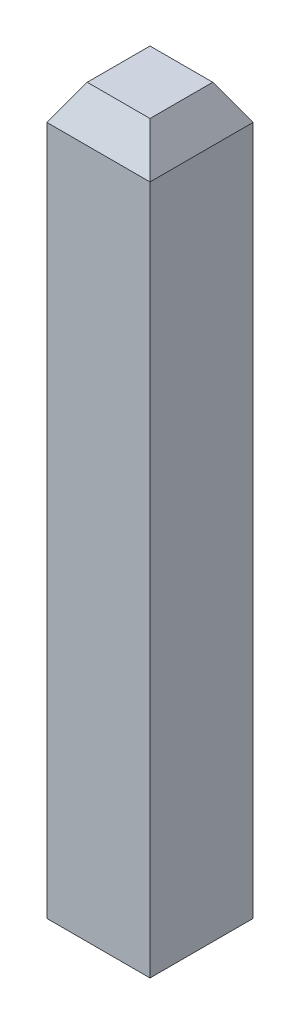
ISO-10303-21;
HEADER;
FILE_DESCRIPTION(('STEP AP214'),'2;1');
FILE_NAME('part.step','',(''),(''),'','','');
FILE_SCHEMA(('AUTOMOTIVE_DESIGN { 1 0 10303 214 1 1 1 1 }'));
ENDSEC;
DATA;
#1=APPLICATION_CONTEXT('core data for automotive mechanical design processes');
#2=APPLICATION_PROTOCOL_DEFINITION('international standard','automotive_design',2000,#1);
#3=PRODUCT_CONTEXT('',#1,'mechanical');
#4=PRODUCT('Part','Part','',(#3));
#5=PRODUCT_RELATED_PRODUCT_CATEGORY('part','',(#4));
#6=PRODUCT_DEFINITION_FORMATION('','',#4);
#7=PRODUCT_DEFINITION_CONTEXT('part definition',#1,'design');
#8=PRODUCT_DEFINITION('design','',#6,#7);
#9=PRODUCT_DEFINITION_SHAPE('','',#8);
#10=(LENGTH_UNIT() NAMED_UNIT(*) SI_UNIT(.MILLI.,.METRE.));
#11=(NAMED_UNIT(*) PLANE_ANGLE_UNIT() SI_UNIT($,.RADIAN.));
#12=(NAMED_UNIT(*) SI_UNIT($,.STERADIAN.) SOLID_ANGLE_UNIT());
#13=UNCERTAINTY_MEASURE_WITH_UNIT(LENGTH_MEASURE(1.E-05),#10,'distance_accuracy_value','');
#14=(GEOMETRIC_REPRESENTATION_CONTEXT(3) GLOBAL_UNCERTAINTY_ASSIGNED_CONTEXT((#13)) GLOBAL_UNIT_ASSIGNED_CONTEXT((#10,
#11,#12)) REPRESENTATION_CONTEXT('',''));
#15=CARTESIAN_POINT('',(0.,0.,0.));
#16=DIRECTION('',(0.,0.,1.));
#17=DIRECTION('',(1.,0.,0.));
#18=AXIS2_PLACEMENT_3D('',#15,#16,#17);
#19=CARTESIAN_POINT('',(1.57,6.8,0.18));
#20=DIRECTION('',(-1.,0.,0.));
#21=DIRECTION('',(0.,0.,1.));
#22=AXIS2_PLACEMENT_3D('',#19,#20,#21);
#23=PLANE('',#22);
#24=DIRECTION('',(0.,-1.,0.));
#25=VECTOR('',#24,1.);
#26=CARTESIAN_POINT('',(1.57,6.8,0.18));
#27=LINE('',#26,#25);
#28=CARTESIAN_POINT('',(1.57,6.58349364905389,0.18));
#29=VERTEX_POINT('',#28);
#30=CARTESIAN_POINT('',(1.57,2.3,0.18));
#31=VERTEX_POINT('',#30);
#32=EDGE_CURVE('E11',#29,#31,#27,.T.);
#33=ORIENTED_EDGE('',*,*,#32,.F.);
#34=DIRECTION('',(0.,0.,1.));
#35=VECTOR('',#34,1.);
#36=CARTESIAN_POINT('',(1.57,6.58349364905389,0.18));
#37=LINE('',#36,#35);
#38=CARTESIAN_POINT('',(1.57,6.58349364905389,0.82));
#39=VERTEX_POINT('',#38);
#40=EDGE_CURVE('E24',#29,#39,#37,.T.);
#41=ORIENTED_EDGE('',*,*,#40,.T.);
#42=DIRECTION('',(0.,-1.,0.));
#43=VECTOR('',#42,1.);
#44=CARTESIAN_POINT('',(1.57,6.8,0.82));
#45=LINE('',#44,#43);
#46=CARTESIAN_POINT('',(1.57,2.3,0.82));
#47=VERTEX_POINT('',#46);
#48=EDGE_CURVE('E117',#39,#47,#45,.T.);
#49=ORIENTED_EDGE('',*,*,#48,.T.);
#50=DIRECTION('',(0.,0.,-1.));
#51=VECTOR('',#50,1.);
#52=CARTESIAN_POINT('',(1.57,2.3,0.18));
#53=LINE('',#52,#51);
#54=EDGE_CURVE('E115',#47,#31,#53,.T.);
#55=ORIENTED_EDGE('',*,*,#54,.T.);
#56=EDGE_LOOP('',(#33,#41,#49,#55));
#57=FACE_BOUND('',#56,.T.);
#58=ADVANCED_FACE('F17',(#57),#23,.F.);
#59=CARTESIAN_POINT('',(0.93,6.8,0.18));
#60=DIRECTION('',(0.,0.,1.));
#61=DIRECTION('',(1.,0.,0.));
#62=AXIS2_PLACEMENT_3D('',#59,#60,#61);
#63=PLANE('',#62);
#64=DIRECTION('',(0.,-1.,0.));
#65=VECTOR('',#64,1.);
#66=CARTESIAN_POINT('',(0.93,6.8,0.18));
#67=LINE('',#66,#65);
#68=CARTESIAN_POINT('',(0.93,6.58349364905389,0.18));
#69=VERTEX_POINT('',#68);
#70=CARTESIAN_POINT('',(0.93,2.3,0.18));
#71=VERTEX_POINT('',#70);
#72=EDGE_CURVE('E113',#69,#71,#67,.T.);
#73=ORIENTED_EDGE('',*,*,#72,.F.);
#74=DIRECTION('',(1.,0.,0.));
#75=VECTOR('',#74,1.);
#76=CARTESIAN_POINT('',(0.93,6.58349364905389,0.18));
#77=LINE('',#76,#75);
#78=EDGE_CURVE('E111',#69,#29,#77,.T.);
#79=ORIENTED_EDGE('',*,*,#78,.T.);
#80=ORIENTED_EDGE('',*,*,#32,.T.);
#81=DIRECTION('',(-1.,0.,0.));
#82=VECTOR('',#81,1.);
#83=CARTESIAN_POINT('',(0.93,2.3,0.18));
#84=LINE('',#83,#82);
#85=EDGE_CURVE('E109',#31,#71,#84,.T.);
#86=ORIENTED_EDGE('',*,*,#85,.T.);
#87=EDGE_LOOP('',(#73,#79,#80,#86));
#88=FACE_BOUND('',#87,.T.);
#89=ADVANCED_FACE('F139',(#88),#63,.F.);
#90=CARTESIAN_POINT('',(0.93,6.8,0.82));
#91=DIRECTION('',(1.,0.,0.));
#92=DIRECTION('',(0.,0.,-1.));
#93=AXIS2_PLACEMENT_3D('',#90,#91,#92);
#94=PLANE('',#93);
#95=DIRECTION('',(0.,-1.,0.));
#96=VECTOR('',#95,1.);
#97=CARTESIAN_POINT('',(0.93,6.8,0.82));
#98=LINE('',#97,#96);
#99=CARTESIAN_POINT('',(0.93,6.58349364905389,0.82));
#100=VERTEX_POINT('',#99);
#101=CARTESIAN_POINT('',(0.93,2.3,0.82));
#102=VERTEX_POINT('',#101);
#103=EDGE_CURVE('E107',#100,#102,#98,.T.);
#104=ORIENTED_EDGE('',*,*,#103,.F.);
#105=DIRECTION('',(0.,0.,-1.));
#106=VECTOR('',#105,1.);
#107=CARTESIAN_POINT('',(0.93,6.58349364905389,0.82));
#108=LINE('',#107,#106);
#109=EDGE_CURVE('E104',#100,#69,#108,.T.);
#110=ORIENTED_EDGE('',*,*,#109,.T.);
#111=ORIENTED_EDGE('',*,*,#72,.T.);
#112=DIRECTION('',(0.,0.,1.));
#113=VECTOR('',#112,1.);
#114=CARTESIAN_POINT('',(0.93,2.3,0.82));
#115=LINE('',#114,#113);
#116=EDGE_CURVE('E101',#71,#102,#115,.T.);
#117=ORIENTED_EDGE('',*,*,#116,.T.);
#118=EDGE_LOOP('',(#104,#110,#111,#117));
#119=FACE_BOUND('',#118,.T.);
#120=ADVANCED_FACE('F134',(#119),#94,.F.);
#121=CARTESIAN_POINT('',(1.57,6.8,0.82));
#122=DIRECTION('',(0.,0.,-1.));
#123=DIRECTION('',(-1.,0.,0.));
#124=AXIS2_PLACEMENT_3D('',#121,#122,#123);
#125=PLANE('',#124);
#126=ORIENTED_EDGE('',*,*,#48,.F.);
#127=DIRECTION('',(-1.,0.,0.));
#128=VECTOR('',#127,1.);
#129=CARTESIAN_POINT('',(1.57,6.58349364905389,0.82));
#130=LINE('',#129,#128);
#131=EDGE_CURVE('E98',#39,#100,#130,.T.);
#132=ORIENTED_EDGE('',*,*,#131,.T.);
#133=ORIENTED_EDGE('',*,*,#103,.T.);
#134=DIRECTION('',(1.,0.,0.));
#135=VECTOR('',#134,1.);
#136=CARTESIAN_POINT('',(1.57,2.3,0.82));
#137=LINE('',#136,#135);
#138=EDGE_CURVE('E95',#102,#47,#137,.T.);
#139=ORIENTED_EDGE('',*,*,#138,.T.);
#140=EDGE_LOOP('',(#126,#132,#133,#139));
#141=FACE_BOUND('',#140,.T.);
#142=ADVANCED_FACE('F122',(#141),#125,.F.);
#143=CARTESIAN_POINT('',(0.,6.8,0.));
#144=DIRECTION('',(0.,-1.,0.));
#145=DIRECTION('',(0.,0.,-1.));
#146=AXIS2_PLACEMENT_3D('',#143,#144,#145);
#147=PLANE('',#146);
#148=DIRECTION('',(0.,0.,1.));
#149=VECTOR('',#148,1.);
#150=CARTESIAN_POINT('',(1.055,6.8,0.));
#151=LINE('',#150,#149);
#152=CARTESIAN_POINT('',(1.055,6.8,0.305000000000001));
#153=VERTEX_POINT('',#152);
#154=CARTESIAN_POINT('',(1.055,6.8,0.694999999999999));
#155=VERTEX_POINT('',#154);
#156=EDGE_CURVE('E93',#153,#155,#151,.T.);
#157=ORIENTED_EDGE('',*,*,#156,.T.);
#158=DIRECTION('',(1.,0.,0.));
#159=VECTOR('',#158,1.);
#160=CARTESIAN_POINT('',(0.,6.8,0.694999999999999));
#161=LINE('',#160,#159);
#162=CARTESIAN_POINT('',(1.445,6.8,0.694999999999999));
#163=VERTEX_POINT('',#162);
#164=EDGE_CURVE('E72',#155,#163,#161,.T.);
#165=ORIENTED_EDGE('',*,*,#164,.T.);
#166=DIRECTION('',(0.,0.,-1.));
#167=VECTOR('',#166,1.);
#168=CARTESIAN_POINT('',(1.445,6.8,0.));
#169=LINE('',#168,#167);
#170=CARTESIAN_POINT('',(1.445,6.8,0.305000000000001));
#171=VERTEX_POINT('',#170);
#172=EDGE_CURVE('E66',#163,#171,#169,.T.);
#173=ORIENTED_EDGE('',*,*,#172,.T.);
#174=DIRECTION('',(-1.,0.,0.));
#175=VECTOR('',#174,1.);
#176=CARTESIAN_POINT('',(0.,6.8,0.305000000000001));
#177=LINE('',#176,#175);
#178=EDGE_CURVE('E69',#171,#153,#177,.T.);
#179=ORIENTED_EDGE('',*,*,#178,.T.);
#180=EDGE_LOOP('',(#157,#165,#173,#179));
#181=FACE_BOUND('',#180,.T.);
#182=ADVANCED_FACE('F68',(#181),#147,.F.);
#183=CARTESIAN_POINT('',(0.,2.3,0.));
#184=DIRECTION('',(0.,-1.,0.));
#185=DIRECTION('',(0.,0.,-1.));
#186=AXIS2_PLACEMENT_3D('',#183,#184,#185);
#187=PLANE('',#186);
#188=ORIENTED_EDGE('',*,*,#54,.F.);
#189=ORIENTED_EDGE('',*,*,#138,.F.);
#190=ORIENTED_EDGE('',*,*,#116,.F.);
#191=ORIENTED_EDGE('',*,*,#85,.F.);
#192=EDGE_LOOP('',(#188,#189,#190,#191));
#193=FACE_BOUND('',#192,.T.);
#194=ADVANCED_FACE('F138',(#193),#187,.T.);
#195=CARTESIAN_POINT('',(0.,6.8,0.305000000000001));
#196=DIRECTION('',(0.,-0.500000000000006,0.866025403784435));
#197=DIRECTION('',(-1.,0.,0.));
#198=AXIS2_PLACEMENT_3D('',#195,#196,#197);
#199=PLANE('',#198);
#200=DIRECTION('',(-0.447213595499962,0.774596669241479,0.447213595499962));
#201=VECTOR('',#200,1.);
#202=CARTESIAN_POINT('',(1.506,6.6943449007383,0.243999999999999));
#203=LINE('',#202,#201);
#204=EDGE_CURVE('E82',#29,#171,#203,.T.);
#205=ORIENTED_EDGE('',*,*,#204,.F.);
#206=ORIENTED_EDGE('',*,*,#78,.F.);
#207=DIRECTION('',(-0.447213595499962,-0.774596669241479,-0.447213595499962));
#208=VECTOR('',#207,1.);
#209=CARTESIAN_POINT('',(0.843999999999997,6.43453727960297,0.0939999999999969));
#210=LINE('',#209,#208);
#211=EDGE_CURVE('E84',#153,#69,#210,.T.);
#212=ORIENTED_EDGE('',*,*,#211,.F.);
#213=ORIENTED_EDGE('',*,*,#178,.F.);
#214=EDGE_LOOP('',(#205,#206,#212,#213));
#215=FACE_BOUND('',#214,.T.);
#216=ADVANCED_FACE('F80',(#215),#199,.F.);
#217=CARTESIAN_POINT('',(1.055,6.8,0.));
#218=DIRECTION('',(0.866025403784435,-0.500000000000006,0.));
#219=DIRECTION('',(0.,0.,1.));
#220=AXIS2_PLACEMENT_3D('',#217,#218,#219);
#221=PLANE('',#220);
#222=ORIENTED_EDGE('',*,*,#211,.T.);
#223=ORIENTED_EDGE('',*,*,#109,.F.);
#224=DIRECTION('',(-0.447213595499962,-0.774596669241479,0.447213595499962));
#225=VECTOR('',#224,1.);
#226=CARTESIAN_POINT('',(1.194,7.04075506225208,0.555999999999997));
#227=LINE('',#226,#225);
#228=EDGE_CURVE('E88',#155,#100,#227,.T.);
#229=ORIENTED_EDGE('',*,*,#228,.F.);
#230=ORIENTED_EDGE('',*,*,#156,.F.);
#231=EDGE_LOOP('',(#222,#223,#229,#230));
#232=FACE_BOUND('',#231,.T.);
#233=ADVANCED_FACE('F132',(#232),#221,.F.);
#234=CARTESIAN_POINT('',(1.445,6.8,0.));
#235=DIRECTION('',(-0.866025403784435,-0.500000000000005,0.));
#236=DIRECTION('',(0.,0.,-1.));
#237=AXIS2_PLACEMENT_3D('',#234,#235,#236);
#238=PLANE('',#237);
#239=ORIENTED_EDGE('',*,*,#204,.T.);
#240=ORIENTED_EDGE('',*,*,#172,.F.);
#241=DIRECTION('',(-0.447213595499962,0.774596669241479,-0.447213595499962));
#242=VECTOR('',#241,1.);
#243=CARTESIAN_POINT('',(1.306,7.04075506225208,0.555999999999997));
#244=LINE('',#243,#242);
#245=EDGE_CURVE('E127',#39,#163,#244,.T.);
#246=ORIENTED_EDGE('',*,*,#245,.F.);
#247=ORIENTED_EDGE('',*,*,#40,.F.);
#248=EDGE_LOOP('',(#239,#240,#246,#247));
#249=FACE_BOUND('',#248,.T.);
#250=ADVANCED_FACE('F86',(#249),#238,.F.);
#251=CARTESIAN_POINT('',(0.,6.8,0.694999999999999));
#252=DIRECTION('',(0.,-0.500000000000005,-0.866025403784435));
#253=DIRECTION('',(1.,0.,0.));
#254=AXIS2_PLACEMENT_3D('',#251,#252,#253);
#255=PLANE('',#254);
#256=ORIENTED_EDGE('',*,*,#228,.T.);
#257=ORIENTED_EDGE('',*,*,#131,.F.);
#258=ORIENTED_EDGE('',*,*,#245,.T.);
#259=ORIENTED_EDGE('',*,*,#164,.F.);
#260=EDGE_LOOP('',(#256,#257,#258,#259));
#261=FACE_BOUND('',#260,.T.);
#262=ADVANCED_FACE('F126',(#261),#255,.F.);
#263=CLOSED_SHELL('',(#58,#89,#120,#142,#182,#194,#216,#233,#250,#262));
#264=MANIFOLD_SOLID_BREP('B1',#263);
#265=ADVANCED_BREP_SHAPE_REPRESENTATION('',(#18,#264),#14);
#266=SHAPE_DEFINITION_REPRESENTATION(#9,#265);
ENDSEC;
END-ISO-10303-21;
